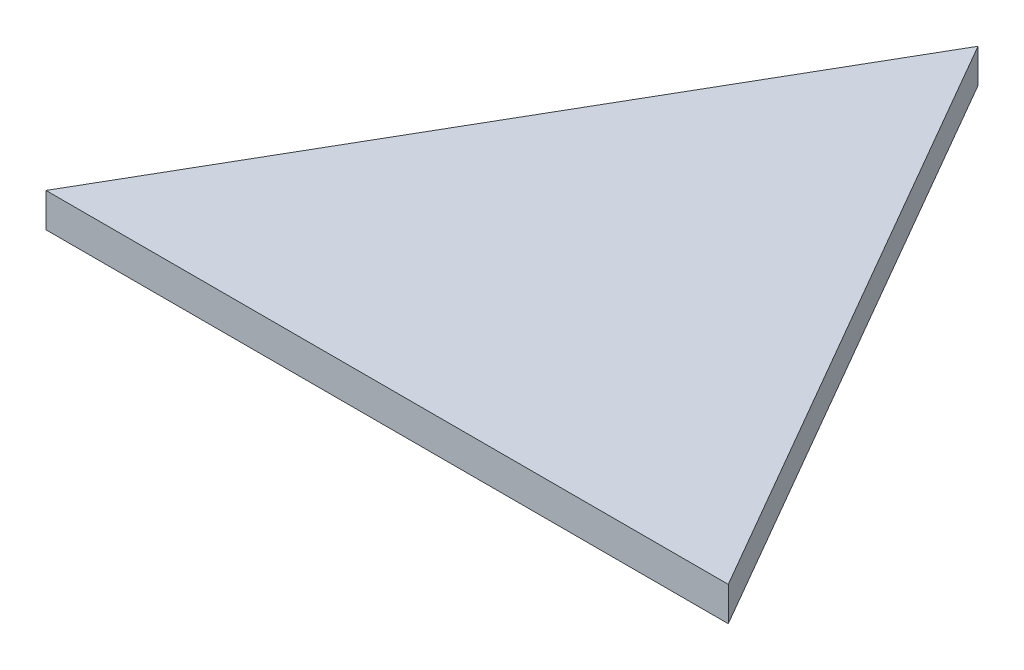
ISO-10303-21;
HEADER;
FILE_DESCRIPTION(('STEP AP214'),'2;1');
FILE_NAME('part.step','',(''),(''),'','','');
FILE_SCHEMA(('AUTOMOTIVE_DESIGN { 1 0 10303 214 1 1 1 1 }'));
ENDSEC;
DATA;
#1=APPLICATION_CONTEXT('core data for automotive mechanical design processes');
#2=APPLICATION_PROTOCOL_DEFINITION('international standard','automotive_design',2000,#1);
#3=PRODUCT_CONTEXT('',#1,'mechanical');
#4=PRODUCT('Part','Part','',(#3));
#5=PRODUCT_RELATED_PRODUCT_CATEGORY('part','',(#4));
#6=PRODUCT_DEFINITION_FORMATION('','',#4);
#7=PRODUCT_DEFINITION_CONTEXT('part definition',#1,'design');
#8=PRODUCT_DEFINITION('design','',#6,#7);
#9=PRODUCT_DEFINITION_SHAPE('','',#8);
#10=(LENGTH_UNIT() NAMED_UNIT(*) SI_UNIT(.MILLI.,.METRE.));
#11=(NAMED_UNIT(*) PLANE_ANGLE_UNIT() SI_UNIT($,.RADIAN.));
#12=(NAMED_UNIT(*) SI_UNIT($,.STERADIAN.) SOLID_ANGLE_UNIT());
#13=UNCERTAINTY_MEASURE_WITH_UNIT(LENGTH_MEASURE(1.E-05),#10,'distance_accuracy_value','');
#14=(GEOMETRIC_REPRESENTATION_CONTEXT(3) GLOBAL_UNCERTAINTY_ASSIGNED_CONTEXT((#13)) GLOBAL_UNIT_ASSIGNED_CONTEXT((#10,
#11,#12)) REPRESENTATION_CONTEXT('',''));
#15=CARTESIAN_POINT('',(0.,0.,0.));
#16=DIRECTION('',(0.,0.,1.));
#17=DIRECTION('',(1.,0.,0.));
#18=AXIS2_PLACEMENT_3D('',#15,#16,#17);
#19=CARTESIAN_POINT('',(12.7,1.27,-21.9970452561247));
#20=DIRECTION('',(0.866025403784439,0.,0.5));
#21=DIRECTION('',(0.5,0.,-0.866025403784439));
#22=AXIS2_PLACEMENT_3D('',#19,#20,#21);
#23=PLANE('',#22);
#24=DIRECTION('',(-0.5,0.,0.866025403784439));
#25=VECTOR('',#24,1.);
#26=CARTESIAN_POINT('',(12.7,0.,-21.9970452561247));
#27=LINE('',#26,#25);
#28=CARTESIAN_POINT('',(12.7,0.,-21.9970452561247));
#29=VERTEX_POINT('',#28);
#30=CARTESIAN_POINT('',(0.,0.,0.));
#31=VERTEX_POINT('',#30);
#32=EDGE_CURVE('E79',#29,#31,#27,.T.);
#33=ORIENTED_EDGE('',*,*,#32,.T.);
#34=DIRECTION('',(0.,-1.,0.));
#35=VECTOR('',#34,1.);
#36=CARTESIAN_POINT('',(0.,1.27,0.));
#37=LINE('',#36,#35);
#38=CARTESIAN_POINT('',(0.,1.27,0.));
#39=VERTEX_POINT('',#38);
#40=EDGE_CURVE('E11',#39,#31,#37,.T.);
#41=ORIENTED_EDGE('',*,*,#40,.F.);
#42=DIRECTION('',(-0.5,0.,0.866025403784439));
#43=VECTOR('',#42,1.);
#44=CARTESIAN_POINT('',(12.7,1.27,-21.9970452561247));
#45=LINE('',#44,#43);
#46=CARTESIAN_POINT('',(12.7,1.27,-21.9970452561247));
#47=VERTEX_POINT('',#46);
#48=EDGE_CURVE('E72',#47,#39,#45,.T.);
#49=ORIENTED_EDGE('',*,*,#48,.F.);
#50=DIRECTION('',(0.,-1.,0.));
#51=VECTOR('',#50,1.);
#52=CARTESIAN_POINT('',(12.7,1.27,-21.9970452561247));
#53=LINE('',#52,#51);
#54=EDGE_CURVE('E80',#47,#29,#53,.T.);
#55=ORIENTED_EDGE('',*,*,#54,.T.);
#56=EDGE_LOOP('',(#33,#41,#49,#55));
#57=FACE_BOUND('',#56,.T.);
#58=ADVANCED_FACE('F32',(#57),#23,.F.);
#59=CARTESIAN_POINT('',(0.,1.27,0.));
#60=DIRECTION('',(0.,0.,-1.));
#61=DIRECTION('',(-1.,0.,0.));
#62=AXIS2_PLACEMENT_3D('',#59,#60,#61);
#63=PLANE('',#62);
#64=DIRECTION('',(1.,0.,0.));
#65=VECTOR('',#64,1.);
#66=CARTESIAN_POINT('',(0.,0.,0.));
#67=LINE('',#66,#65);
#68=CARTESIAN_POINT('',(25.4,0.,0.));
#69=VERTEX_POINT('',#68);
#70=EDGE_CURVE('E60',#31,#69,#67,.T.);
#71=ORIENTED_EDGE('',*,*,#70,.T.);
#72=DIRECTION('',(0.,-1.,0.));
#73=VECTOR('',#72,1.);
#74=CARTESIAN_POINT('',(25.4,1.27,0.));
#75=LINE('',#74,#73);
#76=CARTESIAN_POINT('',(25.4,1.27,0.));
#77=VERTEX_POINT('',#76);
#78=EDGE_CURVE('E40',#77,#69,#75,.T.);
#79=ORIENTED_EDGE('',*,*,#78,.F.);
#80=DIRECTION('',(1.,0.,0.));
#81=VECTOR('',#80,1.);
#82=CARTESIAN_POINT('',(0.,1.27,0.));
#83=LINE('',#82,#81);
#84=EDGE_CURVE('E68',#39,#77,#83,.T.);
#85=ORIENTED_EDGE('',*,*,#84,.F.);
#86=ORIENTED_EDGE('',*,*,#40,.T.);
#87=EDGE_LOOP('',(#71,#79,#85,#86));
#88=FACE_BOUND('',#87,.T.);
#89=ADVANCED_FACE('F69',(#88),#63,.F.);
#90=CARTESIAN_POINT('',(25.4,1.27,0.));
#91=DIRECTION('',(-0.866025403784439,0.,0.5));
#92=DIRECTION('',(0.5,0.,0.866025403784439));
#93=AXIS2_PLACEMENT_3D('',#90,#91,#92);
#94=PLANE('',#93);
#95=DIRECTION('',(-0.5,0.,-0.866025403784439));
#96=VECTOR('',#95,1.);
#97=CARTESIAN_POINT('',(25.4,0.,0.));
#98=LINE('',#97,#96);
#99=EDGE_CURVE('E65',#69,#29,#98,.T.);
#100=ORIENTED_EDGE('',*,*,#99,.T.);
#101=ORIENTED_EDGE('',*,*,#54,.F.);
#102=DIRECTION('',(-0.5,0.,-0.866025403784439));
#103=VECTOR('',#102,1.);
#104=CARTESIAN_POINT('',(25.4,1.27,0.));
#105=LINE('',#104,#103);
#106=EDGE_CURVE('E48',#77,#47,#105,.T.);
#107=ORIENTED_EDGE('',*,*,#106,.F.);
#108=ORIENTED_EDGE('',*,*,#78,.T.);
#109=EDGE_LOOP('',(#100,#101,#107,#108));
#110=FACE_BOUND('',#109,.T.);
#111=ADVANCED_FACE('F87',(#110),#94,.F.);
#112=CARTESIAN_POINT('',(0.,1.27,0.));
#113=DIRECTION('',(0.,1.,0.));
#114=DIRECTION('',(0.,0.,1.));
#115=AXIS2_PLACEMENT_3D('',#112,#113,#114);
#116=PLANE('',#115);
#117=ORIENTED_EDGE('',*,*,#48,.T.);
#118=ORIENTED_EDGE('',*,*,#84,.T.);
#119=ORIENTED_EDGE('',*,*,#106,.T.);
#120=EDGE_LOOP('',(#117,#118,#119));
#121=FACE_BOUND('',#120,.T.);
#122=ADVANCED_FACE('F75',(#121),#116,.T.);
#123=CARTESIAN_POINT('',(0.,0.,0.));
#124=DIRECTION('',(0.,1.,0.));
#125=DIRECTION('',(0.,0.,1.));
#126=AXIS2_PLACEMENT_3D('',#123,#124,#125);
#127=PLANE('',#126);
#128=ORIENTED_EDGE('',*,*,#32,.F.);
#129=ORIENTED_EDGE('',*,*,#99,.F.);
#130=ORIENTED_EDGE('',*,*,#70,.F.);
#131=EDGE_LOOP('',(#128,#129,#130));
#132=FACE_BOUND('',#131,.T.);
#133=ADVANCED_FACE('F88',(#132),#127,.F.);
#134=CLOSED_SHELL('',(#58,#89,#111,#122,#133));
#135=MANIFOLD_SOLID_BREP('B2',#134);
#136=ADVANCED_BREP_SHAPE_REPRESENTATION('',(#18,#135),#14);
#137=SHAPE_DEFINITION_REPRESENTATION(#9,#136);
ENDSEC;
END-ISO-10303-21;
